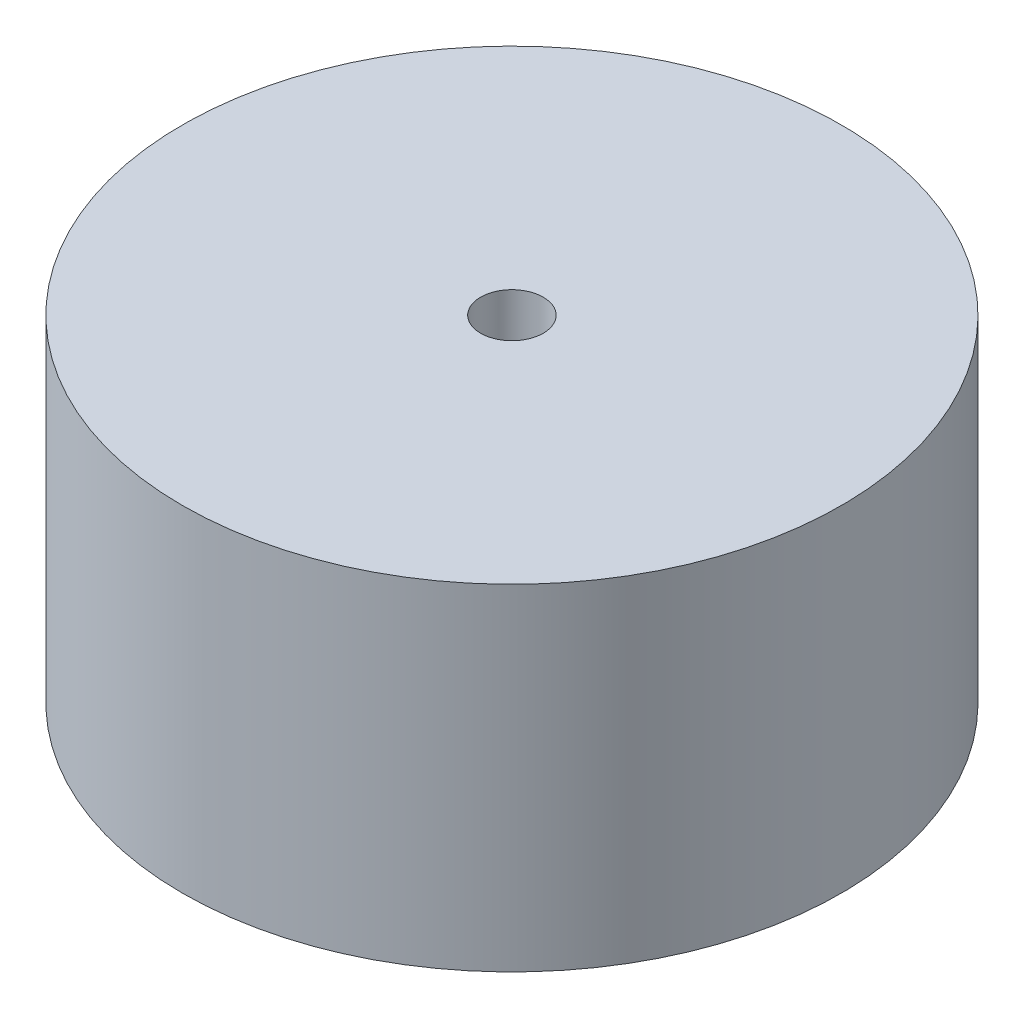
ISO-10303-21;
HEADER;
FILE_DESCRIPTION(('STEP AP214'),'2;1');
FILE_NAME('part.step','',(''),(''),'','','');
FILE_SCHEMA(('AUTOMOTIVE_DESIGN { 1 0 10303 214 1 1 1 1 }'));
ENDSEC;
DATA;
#1=APPLICATION_CONTEXT('core data for automotive mechanical design processes');
#2=APPLICATION_PROTOCOL_DEFINITION('international standard','automotive_design',2000,#1);
#3=PRODUCT_CONTEXT('',#1,'mechanical');
#4=PRODUCT('Part','Part','',(#3));
#5=PRODUCT_RELATED_PRODUCT_CATEGORY('part','',(#4));
#6=PRODUCT_DEFINITION_FORMATION('','',#4);
#7=PRODUCT_DEFINITION_CONTEXT('part definition',#1,'design');
#8=PRODUCT_DEFINITION('design','',#6,#7);
#9=PRODUCT_DEFINITION_SHAPE('','',#8);
#10=(LENGTH_UNIT() NAMED_UNIT(*) SI_UNIT(.MILLI.,.METRE.));
#11=(NAMED_UNIT(*) PLANE_ANGLE_UNIT() SI_UNIT($,.RADIAN.));
#12=(NAMED_UNIT(*) SI_UNIT($,.STERADIAN.) SOLID_ANGLE_UNIT());
#13=UNCERTAINTY_MEASURE_WITH_UNIT(LENGTH_MEASURE(1.E-05),#10,'distance_accuracy_value','');
#14=(GEOMETRIC_REPRESENTATION_CONTEXT(3) GLOBAL_UNCERTAINTY_ASSIGNED_CONTEXT((#13)) GLOBAL_UNIT_ASSIGNED_CONTEXT((#10,
#11,#12)) REPRESENTATION_CONTEXT('',''));
#15=CARTESIAN_POINT('',(0.,0.,0.));
#16=DIRECTION('',(0.,0.,1.));
#17=DIRECTION('',(1.,0.,0.));
#18=AXIS2_PLACEMENT_3D('',#15,#16,#17);
#19=CARTESIAN_POINT('',(0.,17.7,0.));
#20=DIRECTION('',(0.,-1.,0.));
#21=DIRECTION('',(0.,0.,-1.));
#22=AXIS2_PLACEMENT_3D('',#19,#20,#21);
#23=CYLINDRICAL_SURFACE('',#22,17.375);
#24=CARTESIAN_POINT('',(0.,17.7,0.));
#25=DIRECTION('',(0.,1.,0.));
#26=DIRECTION('',(0.,0.,1.));
#27=AXIS2_PLACEMENT_3D('',#24,#25,#26);
#28=CIRCLE('',#27,17.375);
#29=CARTESIAN_POINT('',(0.,17.7,17.375));
#30=VERTEX_POINT('',#29);
#31=EDGE_CURVE('E10',#30,#30,#28,.T.);
#32=ORIENTED_EDGE('',*,*,#31,.F.);
#33=EDGE_LOOP('',(#32));
#34=FACE_BOUND('',#33,.T.);
#35=CARTESIAN_POINT('',(0.,0.,0.));
#36=DIRECTION('',(0.,1.,0.));
#37=DIRECTION('',(0.,0.,1.));
#38=AXIS2_PLACEMENT_3D('',#35,#36,#37);
#39=CIRCLE('',#38,17.375);
#40=CARTESIAN_POINT('',(0.,0.,17.375));
#41=VERTEX_POINT('',#40);
#42=EDGE_CURVE('E44',#41,#41,#39,.T.);
#43=ORIENTED_EDGE('',*,*,#42,.T.);
#44=EDGE_LOOP('',(#43));
#45=FACE_BOUND('',#44,.T.);
#46=ADVANCED_FACE('F41',(#34,#45),#23,.T.);
#47=CARTESIAN_POINT('',(0.,17.7,0.));
#48=DIRECTION('',(0.,1.,0.));
#49=DIRECTION('',(0.,0.,1.));
#50=AXIS2_PLACEMENT_3D('',#47,#48,#49);
#51=PLANE('',#50);
#52=CARTESIAN_POINT('',(0.,17.7,0.));
#53=DIRECTION('',(0.,1.,0.));
#54=DIRECTION('',(0.,0.,1.));
#55=AXIS2_PLACEMENT_3D('',#52,#53,#54);
#56=CIRCLE('',#55,1.65);
#57=CARTESIAN_POINT('',(0.,17.7,1.65));
#58=VERTEX_POINT('',#57);
#59=EDGE_CURVE('E67',#58,#58,#56,.F.);
#60=ORIENTED_EDGE('',*,*,#59,.T.);
#61=EDGE_LOOP('',(#60));
#62=FACE_BOUND('',#61,.T.);
#63=ORIENTED_EDGE('',*,*,#31,.T.);
#64=EDGE_LOOP('',(#63));
#65=FACE_BOUND('',#64,.T.);
#66=ADVANCED_FACE('F109',(#62,#65),#51,.T.);
#67=CARTESIAN_POINT('',(0.,0.,0.));
#68=DIRECTION('',(0.,1.,0.));
#69=DIRECTION('',(0.,0.,1.));
#70=AXIS2_PLACEMENT_3D('',#67,#68,#69);
#71=PLANE('',#70);
#72=CARTESIAN_POINT('',(0.,0.,0.));
#73=DIRECTION('',(0.,-1.,0.));
#74=DIRECTION('',(0.,0.,-1.));
#75=AXIS2_PLACEMENT_3D('',#72,#73,#74);
#76=CIRCLE('',#75,13.545);
#77=CARTESIAN_POINT('',(0.,0.,-13.545));
#78=VERTEX_POINT('',#77);
#79=EDGE_CURVE('E55',#78,#78,#76,.T.);
#80=ORIENTED_EDGE('',*,*,#79,.F.);
#81=EDGE_LOOP('',(#80));
#82=FACE_BOUND('',#81,.T.);
#83=ORIENTED_EDGE('',*,*,#42,.F.);
#84=EDGE_LOOP('',(#83));
#85=FACE_BOUND('',#84,.T.);
#86=ADVANCED_FACE('F103',(#82,#85),#71,.F.);
#87=CARTESIAN_POINT('',(0.,5.,0.));
#88=DIRECTION('',(0.,-1.,0.));
#89=DIRECTION('',(0.,0.,-1.));
#90=AXIS2_PLACEMENT_3D('',#87,#88,#89);
#91=CYLINDRICAL_SURFACE('',#90,13.545);
#92=CARTESIAN_POINT('',(0.,5.,0.));
#93=DIRECTION('',(0.,-1.,0.));
#94=DIRECTION('',(0.,0.,-1.));
#95=AXIS2_PLACEMENT_3D('',#92,#93,#94);
#96=CIRCLE('',#95,13.545);
#97=CARTESIAN_POINT('',(0.,5.,-13.545));
#98=VERTEX_POINT('',#97);
#99=EDGE_CURVE('E53',#98,#98,#96,.T.);
#100=ORIENTED_EDGE('',*,*,#99,.F.);
#101=EDGE_LOOP('',(#100));
#102=FACE_BOUND('',#101,.T.);
#103=ORIENTED_EDGE('',*,*,#79,.T.);
#104=EDGE_LOOP('',(#103));
#105=FACE_BOUND('',#104,.T.);
#106=ADVANCED_FACE('F97',(#102,#105),#91,.F.);
#107=CARTESIAN_POINT('',(0.,5.,0.));
#108=DIRECTION('',(0.,-1.,0.));
#109=DIRECTION('',(0.,0.,-1.));
#110=AXIS2_PLACEMENT_3D('',#107,#108,#109);
#111=PLANE('',#110);
#112=CARTESIAN_POINT('',(0.,5.,0.));
#113=DIRECTION('',(0.,-1.,0.));
#114=DIRECTION('',(0.,0.,-1.));
#115=AXIS2_PLACEMENT_3D('',#112,#113,#114);
#116=CIRCLE('',#115,3.48500000000002);
#117=CARTESIAN_POINT('',(0.,5.,-3.48500000000002));
#118=VERTEX_POINT('',#117);
#119=EDGE_CURVE('E63',#118,#118,#116,.T.);
#120=ORIENTED_EDGE('',*,*,#119,.F.);
#121=EDGE_LOOP('',(#120));
#122=FACE_BOUND('',#121,.T.);
#123=ORIENTED_EDGE('',*,*,#99,.T.);
#124=EDGE_LOOP('',(#123));
#125=FACE_BOUND('',#124,.T.);
#126=ADVANCED_FACE('F91',(#122,#125),#111,.T.);
#127=CARTESIAN_POINT('',(0.,4.,0.));
#128=DIRECTION('',(0.,1.,0.));
#129=DIRECTION('',(0.,0.,1.));
#130=AXIS2_PLACEMENT_3D('',#127,#128,#129);
#131=CYLINDRICAL_SURFACE('',#130,3.48500000000002);
#132=CARTESIAN_POINT('',(0.,4.,0.));
#133=DIRECTION('',(0.,-1.,0.));
#134=DIRECTION('',(0.,0.,-1.));
#135=AXIS2_PLACEMENT_3D('',#132,#133,#134);
#136=CIRCLE('',#135,3.48500000000002);
#137=CARTESIAN_POINT('',(0.,4.,-3.48500000000002));
#138=VERTEX_POINT('',#137);
#139=EDGE_CURVE('E59',#138,#138,#136,.T.);
#140=ORIENTED_EDGE('',*,*,#139,.F.);
#141=EDGE_LOOP('',(#140));
#142=FACE_BOUND('',#141,.T.);
#143=ORIENTED_EDGE('',*,*,#119,.T.);
#144=EDGE_LOOP('',(#143));
#145=FACE_BOUND('',#144,.T.);
#146=ADVANCED_FACE('F85',(#142,#145),#131,.T.);
#147=CARTESIAN_POINT('',(0.,4.,0.));
#148=DIRECTION('',(0.,-1.,0.));
#149=DIRECTION('',(0.,0.,-1.));
#150=AXIS2_PLACEMENT_3D('',#147,#148,#149);
#151=PLANE('',#150);
#152=CARTESIAN_POINT('',(0.,4.,0.));
#153=DIRECTION('',(0.,-1.,0.));
#154=DIRECTION('',(0.,0.,-1.));
#155=AXIS2_PLACEMENT_3D('',#152,#153,#154);
#156=CIRCLE('',#155,1.65);
#157=CARTESIAN_POINT('',(0.,4.,-1.65));
#158=VERTEX_POINT('',#157);
#159=EDGE_CURVE('E74',#158,#158,#156,.T.);
#160=ORIENTED_EDGE('',*,*,#159,.F.);
#161=EDGE_LOOP('',(#160));
#162=FACE_BOUND('',#161,.T.);
#163=ORIENTED_EDGE('',*,*,#139,.T.);
#164=EDGE_LOOP('',(#163));
#165=FACE_BOUND('',#164,.T.);
#166=ADVANCED_FACE('F82',(#162,#165),#151,.T.);
#167=CARTESIAN_POINT('',(0.,22.3669047558312,0.));
#168=DIRECTION('',(0.,-1.,0.));
#169=DIRECTION('',(0.,0.,-1.));
#170=AXIS2_PLACEMENT_3D('',#167,#168,#169);
#171=CYLINDRICAL_SURFACE('',#170,1.65);
#172=ORIENTED_EDGE('',*,*,#159,.T.);
#173=EDGE_LOOP('',(#172));
#174=FACE_BOUND('',#173,.T.);
#175=ORIENTED_EDGE('',*,*,#59,.F.);
#176=EDGE_LOOP('',(#175));
#177=FACE_BOUND('',#176,.T.);
#178=ADVANCED_FACE('F79',(#174,#177),#171,.F.);
#179=CLOSED_SHELL('',(#46,#66,#86,#106,#126,#146,#166,#178));
#180=MANIFOLD_SOLID_BREP('B2',#179);
#181=ADVANCED_BREP_SHAPE_REPRESENTATION('',(#18,#180),#14);
#182=SHAPE_DEFINITION_REPRESENTATION(#9,#181);
ENDSEC;
END-ISO-10303-21;
